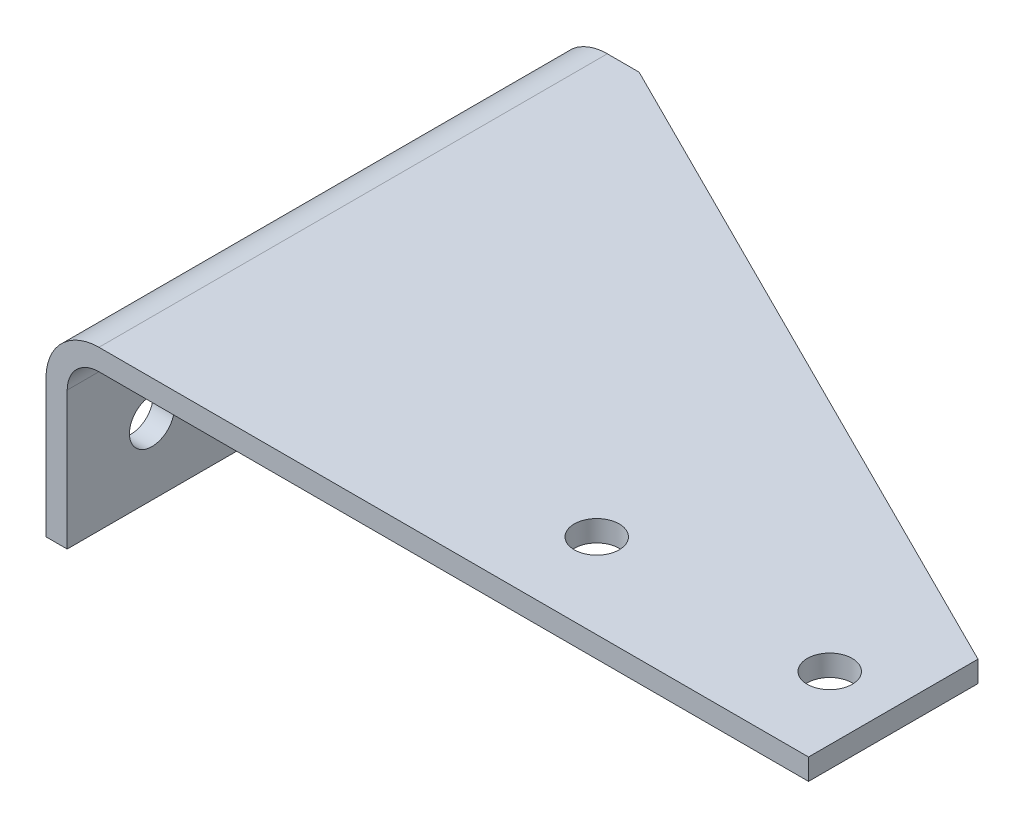
ISO-10303-21;
HEADER;
FILE_DESCRIPTION(('STEP AP214'),'2;1');
FILE_NAME('part.step','',(''),(''),'','','');
FILE_SCHEMA(('AUTOMOTIVE_DESIGN { 1 0 10303 214 1 1 1 1 }'));
ENDSEC;
DATA;
#1=APPLICATION_CONTEXT('core data for automotive mechanical design processes');
#2=APPLICATION_PROTOCOL_DEFINITION('international standard','automotive_design',2000,#1);
#3=PRODUCT_CONTEXT('',#1,'mechanical');
#4=PRODUCT('Part','Part','',(#3));
#5=PRODUCT_RELATED_PRODUCT_CATEGORY('part','',(#4));
#6=PRODUCT_DEFINITION_FORMATION('','',#4);
#7=PRODUCT_DEFINITION_CONTEXT('part definition',#1,'design');
#8=PRODUCT_DEFINITION('design','',#6,#7);
#9=PRODUCT_DEFINITION_SHAPE('','',#8);
#10=(LENGTH_UNIT() NAMED_UNIT(*) SI_UNIT(.MILLI.,.METRE.));
#11=(NAMED_UNIT(*) PLANE_ANGLE_UNIT() SI_UNIT($,.RADIAN.));
#12=(NAMED_UNIT(*) SI_UNIT($,.STERADIAN.) SOLID_ANGLE_UNIT());
#13=UNCERTAINTY_MEASURE_WITH_UNIT(LENGTH_MEASURE(1.E-05),#10,'distance_accuracy_value','');
#14=(GEOMETRIC_REPRESENTATION_CONTEXT(3) GLOBAL_UNCERTAINTY_ASSIGNED_CONTEXT((#13)) GLOBAL_UNIT_ASSIGNED_CONTEXT((#10,
#11,#12)) REPRESENTATION_CONTEXT('',''));
#15=CARTESIAN_POINT('',(0.,0.,0.));
#16=DIRECTION('',(0.,0.,1.));
#17=DIRECTION('',(1.,0.,0.));
#18=AXIS2_PLACEMENT_3D('',#15,#16,#17);
#19=CARTESIAN_POINT('',(6.34999999999986,-57.15,-126.999999999997));
#20=DIRECTION('',(1.,0.,0.));
#21=DIRECTION('',(0.,1.,0.));
#22=AXIS2_PLACEMENT_3D('',#19,#20,#21);
#23=PLANE('',#22);
#24=DIRECTION('',(0.,1.,0.));
#25=VECTOR('',#24,1.);
#26=CARTESIAN_POINT('',(6.3500000000003,-57.1500000000005,25.4000000000003));
#27=LINE('',#26,#25);
#28=CARTESIAN_POINT('',(6.3500000000003,-57.1500000000005,25.4000000000003));
#29=VERTEX_POINT('',#28);
#30=CARTESIAN_POINT('',(6.34999999999919,-15.8749999999999,25.4000000000012));
#31=VERTEX_POINT('',#30);
#32=EDGE_CURVE('E200',#29,#31,#27,.T.);
#33=ORIENTED_EDGE('',*,*,#32,.F.);
#34=DIRECTION('',(0.,0.,1.));
#35=VECTOR('',#34,1.);
#36=CARTESIAN_POINT('',(6.34999999999986,-57.15,-126.999999999997));
#37=LINE('',#36,#35);
#38=CARTESIAN_POINT('',(6.34999999999986,-57.15,-126.999999999997));
#39=VERTEX_POINT('',#38);
#40=EDGE_CURVE('E174',#39,#29,#37,.T.);
#41=ORIENTED_EDGE('',*,*,#40,.F.);
#42=DIRECTION('',(0.,1.,0.));
#43=VECTOR('',#42,1.);
#44=CARTESIAN_POINT('',(6.34999999999986,-57.15,-126.999999999997));
#45=LINE('',#44,#43);
#46=CARTESIAN_POINT('',(6.34999999999986,-15.8750000000007,-126.999999999997));
#47=VERTEX_POINT('',#46);
#48=EDGE_CURVE('E165',#39,#47,#45,.T.);
#49=ORIENTED_EDGE('',*,*,#48,.T.);
#50=DIRECTION('',(0.,0.,1.));
#51=VECTOR('',#50,1.);
#52=CARTESIAN_POINT('',(6.34999999999986,-15.8750000000007,-126.999999999997));
#53=LINE('',#52,#51);
#54=EDGE_CURVE('E171',#47,#31,#53,.T.);
#55=ORIENTED_EDGE('',*,*,#54,.T.);
#56=EDGE_LOOP('',(#33,#41,#49,#55));
#57=FACE_BOUND('',#56,.T.);
#58=CARTESIAN_POINT('',(6.3500000000003,-36.5125000000006,-101.6));
#59=DIRECTION('',(1.,0.,0.));
#60=DIRECTION('',(0.,1.,0.));
#61=AXIS2_PLACEMENT_3D('',#58,#59,#60);
#62=CIRCLE('',#61,6.73099999999998);
#63=CARTESIAN_POINT('',(6.3500000000003,-29.7815000000006,-101.6));
#64=VERTEX_POINT('',#63);
#65=EDGE_CURVE('E212',#64,#64,#62,.F.);
#66=ORIENTED_EDGE('',*,*,#65,.T.);
#67=EDGE_LOOP('',(#66));
#68=FACE_BOUND('',#67,.T.);
#69=CARTESIAN_POINT('',(6.3499999999983,-36.5125000000006,0.));
#70=DIRECTION('',(1.,0.,0.));
#71=DIRECTION('',(0.,1.,0.));
#72=AXIS2_PLACEMENT_3D('',#69,#70,#71);
#73=CIRCLE('',#72,6.731);
#74=CARTESIAN_POINT('',(6.3499999999983,-29.7815000000006,0.));
#75=VERTEX_POINT('',#74);
#76=EDGE_CURVE('E146',#75,#75,#73,.F.);
#77=ORIENTED_EDGE('',*,*,#76,.T.);
#78=EDGE_LOOP('',(#77));
#79=FACE_BOUND('',#78,.T.);
#80=ADVANCED_FACE('F30',(#57,#68,#79),#23,.T.);
#81=CARTESIAN_POINT('',(-1.77635683940025E-12,-15.8750000000007,-126.999999999997));
#82=DIRECTION('',(-1.,0.,0.));
#83=DIRECTION('',(0.,-1.,0.));
#84=AXIS2_PLACEMENT_3D('',#81,#82,#83);
#85=PLANE('',#84);
#86=DIRECTION('',(0.,-1.,0.));
#87=VECTOR('',#86,1.);
#88=CARTESIAN_POINT('',(6.66133814775094E-13,-15.8750000000007,25.4000000000012));
#89=LINE('',#88,#87);
#90=CARTESIAN_POINT('',(6.66133814775094E-13,-15.8750000000007,25.4000000000012));
#91=VERTEX_POINT('',#90);
#92=CARTESIAN_POINT('',(4.44089209850063E-13,-57.1500000000011,25.4000000000003));
#93=VERTEX_POINT('',#92);
#94=EDGE_CURVE('E188',#91,#93,#89,.T.);
#95=ORIENTED_EDGE('',*,*,#94,.F.);
#96=DIRECTION('',(0.,0.,1.));
#97=VECTOR('',#96,1.);
#98=CARTESIAN_POINT('',(-1.77635683940025E-12,-15.8750000000007,-126.999999999997));
#99=LINE('',#98,#97);
#100=CARTESIAN_POINT('',(-1.77635683940025E-12,-15.8750000000007,-126.999999999997));
#101=VERTEX_POINT('',#100);
#102=EDGE_CURVE('E130',#101,#91,#99,.T.);
#103=ORIENTED_EDGE('',*,*,#102,.F.);
#104=DIRECTION('',(0.,-1.,0.));
#105=VECTOR('',#104,1.);
#106=CARTESIAN_POINT('',(-1.77635683940025E-12,-15.8750000000007,-126.999999999997));
#107=LINE('',#106,#105);
#108=CARTESIAN_POINT('',(1.11022302462516E-12,-57.15,-127.000000000001));
#109=VERTEX_POINT('',#108);
#110=EDGE_CURVE('E159',#101,#109,#107,.T.);
#111=ORIENTED_EDGE('',*,*,#110,.T.);
#112=DIRECTION('',(0.,0.,1.));
#113=VECTOR('',#112,1.);
#114=CARTESIAN_POINT('',(1.11022302462516E-12,-57.15,-127.000000000001));
#115=LINE('',#114,#113);
#116=EDGE_CURVE('E177',#109,#93,#115,.T.);
#117=ORIENTED_EDGE('',*,*,#116,.T.);
#118=EDGE_LOOP('',(#95,#103,#111,#117));
#119=FACE_BOUND('',#118,.T.);
#120=CARTESIAN_POINT('',(6.66133814775094E-13,-36.5124999999999,-101.599999999999));
#121=DIRECTION('',(1.,0.,0.));
#122=DIRECTION('',(0.,0.,-1.));
#123=AXIS2_PLACEMENT_3D('',#120,#121,#122);
#124=CIRCLE('',#123,6.73099999999998);
#125=CARTESIAN_POINT('',(6.66133814775094E-13,-36.5124999999999,-108.330999999999));
#126=VERTEX_POINT('',#125);
#127=EDGE_CURVE('E209',#126,#126,#124,.T.);
#128=ORIENTED_EDGE('',*,*,#127,.T.);
#129=EDGE_LOOP('',(#128));
#130=FACE_BOUND('',#129,.T.);
#131=CARTESIAN_POINT('',(0.,-36.5124999999997,2.66453525910038E-12));
#132=DIRECTION('',(1.,0.,0.));
#133=DIRECTION('',(0.,0.,-1.));
#134=AXIS2_PLACEMENT_3D('',#131,#132,#133);
#135=CIRCLE('',#134,6.731);
#136=CARTESIAN_POINT('',(0.,-36.5124999999997,-6.73099999999734));
#137=VERTEX_POINT('',#136);
#138=EDGE_CURVE('E214',#137,#137,#135,.T.);
#139=ORIENTED_EDGE('',*,*,#138,.T.);
#140=EDGE_LOOP('',(#139));
#141=FACE_BOUND('',#140,.T.);
#142=ADVANCED_FACE('F186',(#119,#130,#141),#85,.T.);
#143=CARTESIAN_POINT('',(15.8749999999994,-6.34999999999986,-126.999999999999));
#144=DIRECTION('',(0.,-1.,0.));
#145=DIRECTION('',(1.,0.,0.));
#146=AXIS2_PLACEMENT_3D('',#143,#144,#145);
#147=PLANE('',#146);
#148=DIRECTION('',(1.,0.,0.));
#149=VECTOR('',#148,1.);
#150=CARTESIAN_POINT('',(15.8750000000001,-6.34999999999963,25.4000000000003));
#151=LINE('',#150,#149);
#152=CARTESIAN_POINT('',(15.8750000000001,-6.34999999999963,25.4000000000003));
#153=VERTEX_POINT('',#152);
#154=CARTESIAN_POINT('',(228.599999999999,-6.35000000000097,25.4000000000021));
#155=VERTEX_POINT('',#154);
#156=EDGE_CURVE('E108',#153,#155,#151,.T.);
#157=ORIENTED_EDGE('',*,*,#156,.F.);
#158=DIRECTION('',(0.,0.,1.));
#159=VECTOR('',#158,1.);
#160=CARTESIAN_POINT('',(15.8749999999994,-6.34999999999986,-126.999999999999));
#161=LINE('',#160,#159);
#162=CARTESIAN_POINT('',(15.8749999999994,-6.34999999999986,-126.999999999999));
#163=VERTEX_POINT('',#162);
#164=EDGE_CURVE('E54',#163,#153,#161,.T.);
#165=ORIENTED_EDGE('',*,*,#164,.F.);
#166=DIRECTION('',(1.,0.,0.));
#167=VECTOR('',#166,1.);
#168=CARTESIAN_POINT('',(15.8749999999994,-6.34999999999986,-126.999999999999));
#169=LINE('',#168,#167);
#170=CARTESIAN_POINT('',(25.4000000000001,-6.35000000000052,-126.999999999997));
#171=VERTEX_POINT('',#170);
#172=EDGE_CURVE('E128',#163,#171,#169,.T.);
#173=ORIENTED_EDGE('',*,*,#172,.T.);
#174=DIRECTION('',(0.894427190999915,0.,0.447213595499958));
#175=VECTOR('',#174,1.);
#176=CARTESIAN_POINT('',(17.7800000000008,-6.35000000000141,-130.809999999999));
#177=LINE('',#176,#175);
#178=CARTESIAN_POINT('',(228.599999999999,-6.34999999999963,-25.4000000000021));
#179=VERTEX_POINT('',#178);
#180=EDGE_CURVE('E46',#171,#179,#177,.T.);
#181=ORIENTED_EDGE('',*,*,#180,.T.);
#182=DIRECTION('',(0.,0.,1.));
#183=VECTOR('',#182,1.);
#184=CARTESIAN_POINT('',(228.599999999999,-6.35000000000097,-126.999999999997));
#185=LINE('',#184,#183);
#186=EDGE_CURVE('E39',#179,#155,#185,.T.);
#187=ORIENTED_EDGE('',*,*,#186,.T.);
#188=EDGE_LOOP('',(#157,#165,#173,#181,#187));
#189=FACE_BOUND('',#188,.T.);
#190=CARTESIAN_POINT('',(209.549999999999,-6.35000000000097,0.));
#191=DIRECTION('',(0.,-1.,0.));
#192=DIRECTION('',(1.,0.,0.));
#193=AXIS2_PLACEMENT_3D('',#190,#191,#192);
#194=CIRCLE('',#193,6.73099999999998);
#195=CARTESIAN_POINT('',(216.280999999999,-6.35000000000097,0.));
#196=VERTEX_POINT('',#195);
#197=EDGE_CURVE('E114',#196,#196,#194,.F.);
#198=ORIENTED_EDGE('',*,*,#197,.T.);
#199=EDGE_LOOP('',(#198));
#200=FACE_BOUND('',#199,.T.);
#201=CARTESIAN_POINT('',(139.7,-6.34999999999986,-1.77635683940025E-12));
#202=DIRECTION('',(0.,-1.,0.));
#203=DIRECTION('',(1.,0.,0.));
#204=AXIS2_PLACEMENT_3D('',#201,#202,#203);
#205=CIRCLE('',#204,6.73099999999998);
#206=CARTESIAN_POINT('',(146.431,-6.34999999999985,-1.77523590272344E-12));
#207=VERTEX_POINT('',#206);
#208=EDGE_CURVE('E137',#207,#207,#205,.F.);
#209=ORIENTED_EDGE('',*,*,#208,.T.);
#210=EDGE_LOOP('',(#209));
#211=FACE_BOUND('',#210,.T.);
#212=ADVANCED_FACE('F243',(#189,#200,#211),#147,.T.);
#213=CARTESIAN_POINT('',(228.6,-4.44089209850063E-13,-127.));
#214=DIRECTION('',(0.,1.,0.));
#215=DIRECTION('',(-1.,0.,0.));
#216=AXIS2_PLACEMENT_3D('',#213,#214,#215);
#217=PLANE('',#216);
#218=DIRECTION('',(1.,0.,0.));
#219=VECTOR('',#218,1.);
#220=CARTESIAN_POINT('',(-7.34878845200027,8.88178419700125E-13,25.4000000000003));
#221=LINE('',#220,#219);
#222=CARTESIAN_POINT('',(15.8750000000016,-4.44089209850063E-13,25.4000000000003));
#223=VERTEX_POINT('',#222);
#224=CARTESIAN_POINT('',(228.6,-8.88178419700125E-13,25.4000000000012));
#225=VERTEX_POINT('',#224);
#226=EDGE_CURVE('E106',#223,#225,#221,.T.);
#227=ORIENTED_EDGE('',*,*,#226,.T.);
#228=DIRECTION('',(0.,0.,1.));
#229=VECTOR('',#228,1.);
#230=CARTESIAN_POINT('',(228.6,-4.44089209850063E-13,-127.));
#231=LINE('',#230,#229);
#232=CARTESIAN_POINT('',(228.599999999999,-6.66133814775094E-13,-25.3999999999985));
#233=VERTEX_POINT('',#232);
#234=EDGE_CURVE('E122',#233,#225,#231,.T.);
#235=ORIENTED_EDGE('',*,*,#234,.F.);
#236=DIRECTION('',(-0.894427190999916,0.,-0.447213595499958));
#237=VECTOR('',#236,1.);
#238=CARTESIAN_POINT('',(187.960000000001,6.66133814775094E-13,-45.7199999999984));
#239=LINE('',#238,#237);
#240=CARTESIAN_POINT('',(25.4000000000003,-8.88178419700125E-13,-126.999999999997));
#241=VERTEX_POINT('',#240);
#242=EDGE_CURVE('E151',#233,#241,#239,.T.);
#243=ORIENTED_EDGE('',*,*,#242,.T.);
#244=DIRECTION('',(-1.,0.,0.));
#245=VECTOR('',#244,1.);
#246=CARTESIAN_POINT('',(228.6,-4.44089209850063E-13,-127.));
#247=LINE('',#246,#245);
#248=CARTESIAN_POINT('',(15.875000000001,2.22044604925031E-13,-127.000000000002));
#249=VERTEX_POINT('',#248);
#250=EDGE_CURVE('E154',#241,#249,#247,.T.);
#251=ORIENTED_EDGE('',*,*,#250,.T.);
#252=DIRECTION('',(0.,0.,1.));
#253=VECTOR('',#252,1.);
#254=CARTESIAN_POINT('',(15.875000000001,2.22044604925031E-13,-127.000000000002));
#255=LINE('',#254,#253);
#256=EDGE_CURVE('E124',#249,#223,#255,.T.);
#257=ORIENTED_EDGE('',*,*,#256,.T.);
#258=EDGE_LOOP('',(#227,#235,#243,#251,#257));
#259=FACE_BOUND('',#258,.T.);
#260=CARTESIAN_POINT('',(209.549999999999,8.88178419700125E-13,0.));
#261=DIRECTION('',(0.,1.,0.));
#262=DIRECTION('',(-1.,0.,0.));
#263=AXIS2_PLACEMENT_3D('',#260,#261,#262);
#264=CIRCLE('',#263,6.73099999999998);
#265=CARTESIAN_POINT('',(202.818999999999,8.85562900787562E-13,0.));
#266=VERTEX_POINT('',#265);
#267=EDGE_CURVE('E135',#266,#266,#264,.F.);
#268=ORIENTED_EDGE('',*,*,#267,.T.);
#269=EDGE_LOOP('',(#268));
#270=FACE_BOUND('',#269,.T.);
#271=CARTESIAN_POINT('',(139.7,-2.22044604925031E-13,-8.88178419700125E-13));
#272=DIRECTION('',(0.,1.,0.));
#273=DIRECTION('',(-1.,0.,0.));
#274=AXIS2_PLACEMENT_3D('',#271,#272,#273);
#275=CIRCLE('',#274,6.73099999999998);
#276=CARTESIAN_POINT('',(132.969,-2.24660123837594E-13,-8.88925710818001E-13));
#277=VERTEX_POINT('',#276);
#278=EDGE_CURVE('E34',#277,#277,#275,.F.);
#279=ORIENTED_EDGE('',*,*,#278,.T.);
#280=EDGE_LOOP('',(#279));
#281=FACE_BOUND('',#280,.T.);
#282=ADVANCED_FACE('F119',(#259,#270,#281),#217,.T.);
#283=CARTESIAN_POINT('',(228.599999999999,-6.35000000000097,-126.999999999997));
#284=DIRECTION('',(1.,0.,0.));
#285=DIRECTION('',(0.,0.,-1.));
#286=AXIS2_PLACEMENT_3D('',#283,#284,#285);
#287=PLANE('',#286);
#288=ORIENTED_EDGE('',*,*,#234,.T.);
#289=DIRECTION('',(0.,-1.,0.));
#290=VECTOR('',#289,1.);
#291=CARTESIAN_POINT('',(228.599999999999,508.,25.4000000000012));
#292=LINE('',#291,#290);
#293=EDGE_CURVE('E103',#225,#155,#292,.T.);
#294=ORIENTED_EDGE('',*,*,#293,.T.);
#295=ORIENTED_EDGE('',*,*,#186,.F.);
#296=DIRECTION('',(0.,-1.,0.));
#297=VECTOR('',#296,1.);
#298=CARTESIAN_POINT('',(228.599999999998,508.,-25.3999999999994));
#299=LINE('',#298,#297);
#300=EDGE_CURVE('E113',#233,#179,#299,.T.);
#301=ORIENTED_EDGE('',*,*,#300,.F.);
#302=EDGE_LOOP('',(#288,#294,#295,#301));
#303=FACE_BOUND('',#302,.T.);
#304=ADVANCED_FACE('F32',(#303),#287,.T.);
#305=CARTESIAN_POINT('',(15.8749999999992,-15.8749999999994,-126.999999999999));
#306=DIRECTION('',(0.,0.,1.));
#307=DIRECTION('',(1.,0.,0.));
#308=AXIS2_PLACEMENT_3D('',#305,#306,#307);
#309=PLANE('',#308);
#310=DIRECTION('',(0.,1.,0.));
#311=VECTOR('',#310,1.);
#312=CARTESIAN_POINT('',(25.4000000000005,-15.875000000001,-127.000000000001));
#313=LINE('',#312,#311);
#314=EDGE_CURVE('E11',#171,#241,#313,.T.);
#315=ORIENTED_EDGE('',*,*,#314,.F.);
#316=ORIENTED_EDGE('',*,*,#172,.F.);
#317=CARTESIAN_POINT('',(15.8749999999992,-15.8749999999994,-126.999999999999));
#318=DIRECTION('',(0.,0.,-1.));
#319=DIRECTION('',(-1.,0.,0.));
#320=AXIS2_PLACEMENT_3D('',#317,#318,#319);
#321=CIRCLE('',#320,9.525);
#322=EDGE_CURVE('E132',#47,#163,#321,.T.);
#323=ORIENTED_EDGE('',*,*,#322,.F.);
#324=ORIENTED_EDGE('',*,*,#48,.F.);
#325=DIRECTION('',(1.,0.,0.));
#326=VECTOR('',#325,1.);
#327=CARTESIAN_POINT('',(1.11022302462516E-12,-57.15,-127.000000000001));
#328=LINE('',#327,#326);
#329=EDGE_CURVE('E162',#109,#39,#328,.T.);
#330=ORIENTED_EDGE('',*,*,#329,.F.);
#331=ORIENTED_EDGE('',*,*,#110,.F.);
#332=CARTESIAN_POINT('',(15.8749999999992,-15.8749999999994,-126.999999999999));
#333=DIRECTION('',(0.,0.,1.));
#334=DIRECTION('',(1.,0.,0.));
#335=AXIS2_PLACEMENT_3D('',#332,#333,#334);
#336=CIRCLE('',#335,15.875);
#337=EDGE_CURVE('E156',#249,#101,#336,.T.);
#338=ORIENTED_EDGE('',*,*,#337,.F.);
#339=ORIENTED_EDGE('',*,*,#250,.F.);
#340=EDGE_LOOP('',(#315,#316,#323,#324,#330,#331,#338,#339));
#341=FACE_BOUND('',#340,.T.);
#342=ADVANCED_FACE('F191',(#341),#309,.F.);
#343=CARTESIAN_POINT('',(15.8749999999992,-15.8749999999994,-126.999999999999));
#344=DIRECTION('',(0.,0.,1.));
#345=DIRECTION('',(1.,0.,0.));
#346=AXIS2_PLACEMENT_3D('',#343,#344,#345);
#347=CYLINDRICAL_SURFACE('',#346,9.525);
#348=CARTESIAN_POINT('',(15.8749999999992,-15.8749999999992,25.4000000000003));
#349=DIRECTION('',(0.,0.,-1.));
#350=DIRECTION('',(-1.,0.,0.));
#351=AXIS2_PLACEMENT_3D('',#348,#349,#350);
#352=CIRCLE('',#351,9.525);
#353=EDGE_CURVE('E202',#31,#153,#352,.T.);
#354=ORIENTED_EDGE('',*,*,#353,.F.);
#355=ORIENTED_EDGE('',*,*,#54,.F.);
#356=ORIENTED_EDGE('',*,*,#322,.T.);
#357=ORIENTED_EDGE('',*,*,#164,.T.);
#358=EDGE_LOOP('',(#354,#355,#356,#357));
#359=FACE_BOUND('',#358,.T.);
#360=ADVANCED_FACE('F248',(#359),#347,.F.);
#361=CARTESIAN_POINT('',(1.11022302462516E-12,-57.15,-127.000000000001));
#362=DIRECTION('',(0.,-1.,0.));
#363=DIRECTION('',(0.,0.,-1.));
#364=AXIS2_PLACEMENT_3D('',#361,#362,#363);
#365=PLANE('',#364);
#366=DIRECTION('',(1.,0.,0.));
#367=VECTOR('',#366,1.);
#368=CARTESIAN_POINT('',(4.44089209850063E-13,-57.1500000000011,25.4000000000003));
#369=LINE('',#368,#367);
#370=EDGE_CURVE('E198',#93,#29,#369,.T.);
#371=ORIENTED_EDGE('',*,*,#370,.F.);
#372=ORIENTED_EDGE('',*,*,#116,.F.);
#373=ORIENTED_EDGE('',*,*,#329,.T.);
#374=ORIENTED_EDGE('',*,*,#40,.T.);
#375=EDGE_LOOP('',(#371,#372,#373,#374));
#376=FACE_BOUND('',#375,.T.);
#377=ADVANCED_FACE('F197',(#376),#365,.T.);
#378=CARTESIAN_POINT('',(15.8749999999992,-15.8749999999994,-126.999999999999));
#379=DIRECTION('',(0.,0.,1.));
#380=DIRECTION('',(1.,0.,0.));
#381=AXIS2_PLACEMENT_3D('',#378,#379,#380);
#382=CYLINDRICAL_SURFACE('',#381,15.875);
#383=CARTESIAN_POINT('',(15.8749999999992,-15.8749999999992,25.4000000000003));
#384=DIRECTION('',(0.,0.,-1.));
#385=DIRECTION('',(-1.,0.,0.));
#386=AXIS2_PLACEMENT_3D('',#383,#384,#385);
#387=CIRCLE('',#386,15.875);
#388=EDGE_CURVE('E125',#223,#91,#387,.F.);
#389=ORIENTED_EDGE('',*,*,#388,.F.);
#390=ORIENTED_EDGE('',*,*,#256,.F.);
#391=ORIENTED_EDGE('',*,*,#337,.T.);
#392=ORIENTED_EDGE('',*,*,#102,.T.);
#393=EDGE_LOOP('',(#389,#390,#391,#392));
#394=FACE_BOUND('',#393,.T.);
#395=ADVANCED_FACE('F181',(#394),#382,.T.);
#396=CARTESIAN_POINT('',(25.3999999999992,508.,-126.999999999999));
#397=DIRECTION('',(0.447213595499958,0.,-0.894427190999916));
#398=DIRECTION('',(-0.894427190999915,0.,-0.447213595499958));
#399=AXIS2_PLACEMENT_3D('',#396,#397,#398);
#400=PLANE('',#399);
#401=ORIENTED_EDGE('',*,*,#314,.T.);
#402=ORIENTED_EDGE('',*,*,#242,.F.);
#403=ORIENTED_EDGE('',*,*,#300,.T.);
#404=ORIENTED_EDGE('',*,*,#180,.F.);
#405=EDGE_LOOP('',(#401,#402,#403,#404));
#406=FACE_BOUND('',#405,.T.);
#407=ADVANCED_FACE('F253',(#406),#400,.T.);
#408=CARTESIAN_POINT('',(209.550000000001,508.,2.66453525910038E-12));
#409=DIRECTION('',(0.,-1.,0.));
#410=DIRECTION('',(0.,0.,-1.));
#411=AXIS2_PLACEMENT_3D('',#408,#409,#410);
#412=CYLINDRICAL_SURFACE('',#411,6.73099999999998);
#413=ORIENTED_EDGE('',*,*,#197,.F.);
#414=EDGE_LOOP('',(#413));
#415=FACE_BOUND('',#414,.T.);
#416=ORIENTED_EDGE('',*,*,#267,.F.);
#417=EDGE_LOOP('',(#416));
#418=FACE_BOUND('',#417,.T.);
#419=ADVANCED_FACE('F234',(#415,#418),#412,.F.);
#420=CARTESIAN_POINT('',(139.699999999999,508.,8.88178419700125E-13));
#421=DIRECTION('',(0.,-1.,0.));
#422=DIRECTION('',(0.,0.,-1.));
#423=AXIS2_PLACEMENT_3D('',#420,#421,#422);
#424=CYLINDRICAL_SURFACE('',#423,6.73099999999998);
#425=ORIENTED_EDGE('',*,*,#208,.F.);
#426=EDGE_LOOP('',(#425));
#427=FACE_BOUND('',#426,.T.);
#428=ORIENTED_EDGE('',*,*,#278,.F.);
#429=EDGE_LOOP('',(#428));
#430=FACE_BOUND('',#429,.T.);
#431=ADVANCED_FACE('F226',(#427,#430),#424,.F.);
#432=CARTESIAN_POINT('',(228.599999999999,-36.5125000000004,0.));
#433=DIRECTION('',(-1.,0.,0.));
#434=DIRECTION('',(0.,0.,1.));
#435=AXIS2_PLACEMENT_3D('',#432,#433,#434);
#436=CYLINDRICAL_SURFACE('',#435,6.731);
#437=ORIENTED_EDGE('',*,*,#76,.F.);
#438=EDGE_LOOP('',(#437));
#439=FACE_BOUND('',#438,.T.);
#440=ORIENTED_EDGE('',*,*,#138,.F.);
#441=EDGE_LOOP('',(#440));
#442=FACE_BOUND('',#441,.T.);
#443=ADVANCED_FACE('F222',(#439,#442),#436,.F.);
#444=CARTESIAN_POINT('',(228.600000000001,-36.5125000000004,-101.599999999999));
#445=DIRECTION('',(-1.,0.,0.));
#446=DIRECTION('',(0.,0.,1.));
#447=AXIS2_PLACEMENT_3D('',#444,#445,#446);
#448=CYLINDRICAL_SURFACE('',#447,6.73099999999998);
#449=ORIENTED_EDGE('',*,*,#65,.F.);
#450=EDGE_LOOP('',(#449));
#451=FACE_BOUND('',#450,.T.);
#452=ORIENTED_EDGE('',*,*,#127,.F.);
#453=EDGE_LOOP('',(#452));
#454=FACE_BOUND('',#453,.T.);
#455=ADVANCED_FACE('F225',(#451,#454),#448,.F.);
#456=CARTESIAN_POINT('',(-7.34878845200027,8.88178419700125E-13,25.4000000000003));
#457=DIRECTION('',(0.,0.,-1.));
#458=DIRECTION('',(-1.,0.,0.));
#459=AXIS2_PLACEMENT_3D('',#456,#457,#458);
#460=PLANE('',#459);
#461=ORIENTED_EDGE('',*,*,#353,.T.);
#462=ORIENTED_EDGE('',*,*,#156,.T.);
#463=ORIENTED_EDGE('',*,*,#293,.F.);
#464=ORIENTED_EDGE('',*,*,#226,.F.);
#465=ORIENTED_EDGE('',*,*,#388,.T.);
#466=ORIENTED_EDGE('',*,*,#94,.T.);
#467=ORIENTED_EDGE('',*,*,#370,.T.);
#468=ORIENTED_EDGE('',*,*,#32,.T.);
#469=EDGE_LOOP('',(#461,#462,#463,#464,#465,#466,#467,#468));
#470=FACE_BOUND('',#469,.T.);
#471=ADVANCED_FACE('F105',(#470),#460,.F.);
#472=CLOSED_SHELL('',(#80,#142,#212,#282,#304,#342,#360,#377,#395,#407,#419,#431,#443,#455,#471));
#473=MANIFOLD_SOLID_BREP('B2',#472);
#474=ADVANCED_BREP_SHAPE_REPRESENTATION('',(#18,#473),#14);
#475=SHAPE_DEFINITION_REPRESENTATION(#9,#474);
ENDSEC;
END-ISO-10303-21;
